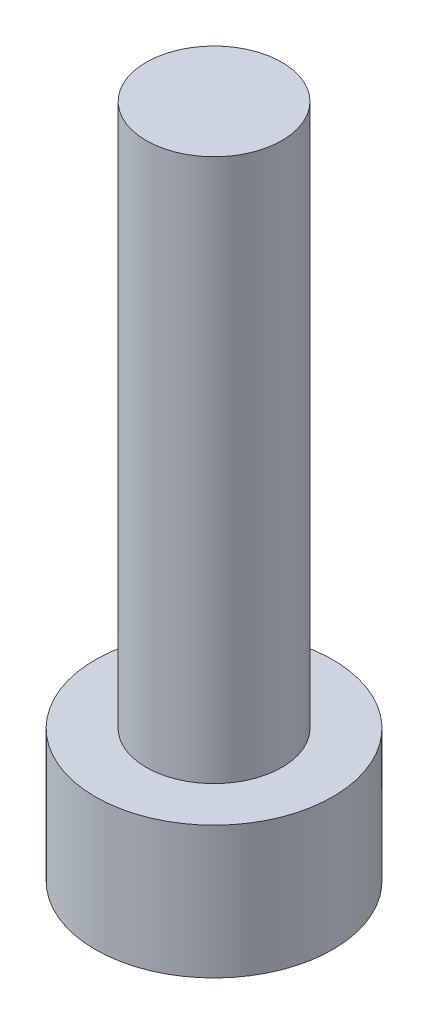
ISO-10303-21;
HEADER;
FILE_DESCRIPTION(('STEP AP214'),'2;1');
FILE_NAME('part.step','',(''),(''),'','','');
FILE_SCHEMA(('AUTOMOTIVE_DESIGN { 1 0 10303 214 1 1 1 1 }'));
ENDSEC;
DATA;
#1=APPLICATION_CONTEXT('core data for automotive mechanical design processes');
#2=APPLICATION_PROTOCOL_DEFINITION('international standard','automotive_design',2000,#1);
#3=PRODUCT_CONTEXT('',#1,'mechanical');
#4=PRODUCT('Part','Part','',(#3));
#5=PRODUCT_RELATED_PRODUCT_CATEGORY('part','',(#4));
#6=PRODUCT_DEFINITION_FORMATION('','',#4);
#7=PRODUCT_DEFINITION_CONTEXT('part definition',#1,'design');
#8=PRODUCT_DEFINITION('design','',#6,#7);
#9=PRODUCT_DEFINITION_SHAPE('','',#8);
#10=(LENGTH_UNIT() NAMED_UNIT(*) SI_UNIT(.MILLI.,.METRE.));
#11=(NAMED_UNIT(*) PLANE_ANGLE_UNIT() SI_UNIT($,.RADIAN.));
#12=(NAMED_UNIT(*) SI_UNIT($,.STERADIAN.) SOLID_ANGLE_UNIT());
#13=UNCERTAINTY_MEASURE_WITH_UNIT(LENGTH_MEASURE(1.E-05),#10,'distance_accuracy_value','');
#14=(GEOMETRIC_REPRESENTATION_CONTEXT(3) GLOBAL_UNCERTAINTY_ASSIGNED_CONTEXT((#13)) GLOBAL_UNIT_ASSIGNED_CONTEXT((#10,
#11,#12)) REPRESENTATION_CONTEXT('',''));
#15=CARTESIAN_POINT('',(0.,0.,0.));
#16=DIRECTION('',(0.,0.,1.));
#17=DIRECTION('',(1.,0.,0.));
#18=AXIS2_PLACEMENT_3D('',#15,#16,#17);
#19=CARTESIAN_POINT('',(0.,3.9,0.));
#20=DIRECTION('',(0.,-1.,0.));
#21=DIRECTION('',(0.,0.,-1.));
#22=AXIS2_PLACEMENT_3D('',#19,#20,#21);
#23=CYLINDRICAL_SURFACE('',#22,3.5);
#24=CARTESIAN_POINT('',(0.,3.9,0.));
#25=DIRECTION('',(0.,1.,0.));
#26=DIRECTION('',(0.,0.,1.));
#27=AXIS2_PLACEMENT_3D('',#24,#25,#26);
#28=CIRCLE('',#27,3.5);
#29=CARTESIAN_POINT('',(0.,3.9,3.5));
#30=VERTEX_POINT('',#29);
#31=EDGE_CURVE('E43',#30,#30,#28,.T.);
#32=ORIENTED_EDGE('',*,*,#31,.F.);
#33=EDGE_LOOP('',(#32));
#34=FACE_BOUND('',#33,.T.);
#35=CARTESIAN_POINT('',(0.,0.,0.));
#36=DIRECTION('',(0.,1.,0.));
#37=DIRECTION('',(0.,0.,1.));
#38=AXIS2_PLACEMENT_3D('',#35,#36,#37);
#39=CIRCLE('',#38,3.5);
#40=CARTESIAN_POINT('',(0.,0.,3.5));
#41=VERTEX_POINT('',#40);
#42=EDGE_CURVE('E38',#41,#41,#39,.T.);
#43=ORIENTED_EDGE('',*,*,#42,.T.);
#44=EDGE_LOOP('',(#43));
#45=FACE_BOUND('',#44,.T.);
#46=ADVANCED_FACE('F35',(#34,#45),#23,.T.);
#47=CARTESIAN_POINT('',(0.,3.9,0.));
#48=DIRECTION('',(0.,1.,0.));
#49=DIRECTION('',(0.,0.,1.));
#50=AXIS2_PLACEMENT_3D('',#47,#48,#49);
#51=PLANE('',#50);
#52=CARTESIAN_POINT('',(0.,3.9,0.));
#53=DIRECTION('',(0.,1.,0.));
#54=DIRECTION('',(0.,0.,1.));
#55=AXIS2_PLACEMENT_3D('',#52,#53,#54);
#56=CIRCLE('',#55,2.);
#57=CARTESIAN_POINT('',(0.,3.9,2.));
#58=VERTEX_POINT('',#57);
#59=EDGE_CURVE('E11',#58,#58,#56,.T.);
#60=ORIENTED_EDGE('',*,*,#59,.F.);
#61=EDGE_LOOP('',(#60));
#62=FACE_BOUND('',#61,.T.);
#63=ORIENTED_EDGE('',*,*,#31,.T.);
#64=EDGE_LOOP('',(#63));
#65=FACE_BOUND('',#64,.T.);
#66=ADVANCED_FACE('F155',(#62,#65),#51,.T.);
#67=CARTESIAN_POINT('',(0.,0.,0.));
#68=DIRECTION('',(0.,1.,0.));
#69=DIRECTION('',(0.,0.,1.));
#70=AXIS2_PLACEMENT_3D('',#67,#68,#69);
#71=PLANE('',#70);
#72=DIRECTION('',(-0.5,0.,0.866025403784438));
#73=VECTOR('',#72,1.);
#74=CARTESIAN_POINT('',(1.725,0.,0.));
#75=LINE('',#74,#73);
#76=CARTESIAN_POINT('',(1.725,0.,0.));
#77=VERTEX_POINT('',#76);
#78=CARTESIAN_POINT('',(0.862499999999999,0.,1.49389382152816));
#79=VERTEX_POINT('',#78);
#80=EDGE_CURVE('E125',#77,#79,#75,.T.);
#81=ORIENTED_EDGE('',*,*,#80,.F.);
#82=DIRECTION('',(0.5,0.,0.866025403784439));
#83=VECTOR('',#82,1.);
#84=CARTESIAN_POINT('',(0.8625,0.,-1.49389382152816));
#85=LINE('',#84,#83);
#86=CARTESIAN_POINT('',(0.8625,0.,-1.49389382152816));
#87=VERTEX_POINT('',#86);
#88=EDGE_CURVE('E51',#87,#77,#85,.T.);
#89=ORIENTED_EDGE('',*,*,#88,.F.);
#90=DIRECTION('',(1.,0.,0.));
#91=VECTOR('',#90,1.);
#92=CARTESIAN_POINT('',(-0.8625,0.,-1.49389382152816));
#93=LINE('',#92,#91);
#94=CARTESIAN_POINT('',(-0.8625,0.,-1.49389382152816));
#95=VERTEX_POINT('',#94);
#96=EDGE_CURVE('E134',#95,#87,#93,.T.);
#97=ORIENTED_EDGE('',*,*,#96,.F.);
#98=DIRECTION('',(0.5,0.,-0.866025403784439));
#99=VECTOR('',#98,1.);
#100=CARTESIAN_POINT('',(-1.725,0.,0.));
#101=LINE('',#100,#99);
#102=CARTESIAN_POINT('',(-1.725,0.,0.));
#103=VERTEX_POINT('',#102);
#104=EDGE_CURVE('E132',#103,#95,#101,.T.);
#105=ORIENTED_EDGE('',*,*,#104,.F.);
#106=DIRECTION('',(-0.5,0.,-0.866025403784439));
#107=VECTOR('',#106,1.);
#108=CARTESIAN_POINT('',(-0.8625,0.,1.49389382152816));
#109=LINE('',#108,#107);
#110=CARTESIAN_POINT('',(-0.8625,0.,1.49389382152816));
#111=VERTEX_POINT('',#110);
#112=EDGE_CURVE('E99',#111,#103,#109,.T.);
#113=ORIENTED_EDGE('',*,*,#112,.F.);
#114=DIRECTION('',(-1.,0.,0.));
#115=VECTOR('',#114,1.);
#116=CARTESIAN_POINT('',(0.862499999999999,0.,1.49389382152816));
#117=LINE('',#116,#115);
#118=EDGE_CURVE('E128',#79,#111,#117,.T.);
#119=ORIENTED_EDGE('',*,*,#118,.F.);
#120=EDGE_LOOP('',(#81,#89,#97,#105,#113,#119));
#121=FACE_BOUND('',#120,.T.);
#122=ORIENTED_EDGE('',*,*,#42,.F.);
#123=EDGE_LOOP('',(#122));
#124=FACE_BOUND('',#123,.T.);
#125=ADVANCED_FACE('F152',(#121,#124),#71,.F.);
#126=CARTESIAN_POINT('',(0.,19.9,0.));
#127=DIRECTION('',(0.,-1.,0.));
#128=DIRECTION('',(0.,0.,-1.));
#129=AXIS2_PLACEMENT_3D('',#126,#127,#128);
#130=CYLINDRICAL_SURFACE('',#129,2.);
#131=CARTESIAN_POINT('',(0.,19.9,0.));
#132=DIRECTION('',(0.,1.,0.));
#133=DIRECTION('',(0.,0.,1.));
#134=AXIS2_PLACEMENT_3D('',#131,#132,#133);
#135=CIRCLE('',#134,2.);
#136=CARTESIAN_POINT('',(0.,19.9,2.));
#137=VERTEX_POINT('',#136);
#138=EDGE_CURVE('E138',#137,#137,#135,.T.);
#139=ORIENTED_EDGE('',*,*,#138,.F.);
#140=EDGE_LOOP('',(#139));
#141=FACE_BOUND('',#140,.T.);
#142=ORIENTED_EDGE('',*,*,#59,.T.);
#143=EDGE_LOOP('',(#142));
#144=FACE_BOUND('',#143,.T.);
#145=ADVANCED_FACE('F154',(#141,#144),#130,.T.);
#146=CARTESIAN_POINT('',(0.,19.9,0.));
#147=DIRECTION('',(0.,1.,0.));
#148=DIRECTION('',(0.,0.,1.));
#149=AXIS2_PLACEMENT_3D('',#146,#147,#148);
#150=PLANE('',#149);
#151=ORIENTED_EDGE('',*,*,#138,.T.);
#152=EDGE_LOOP('',(#151));
#153=FACE_BOUND('',#152,.T.);
#154=ADVANCED_FACE('F161',(#153),#150,.T.);
#155=CARTESIAN_POINT('',(0.8625,2.4,-1.49389382152816));
#156=DIRECTION('',(0.866025403784439,0.,-0.5));
#157=DIRECTION('',(-0.5,0.,-0.866025403784439));
#158=AXIS2_PLACEMENT_3D('',#155,#156,#157);
#159=PLANE('',#158);
#160=ORIENTED_EDGE('',*,*,#88,.T.);
#161=DIRECTION('',(0.,-1.,0.));
#162=VECTOR('',#161,1.);
#163=CARTESIAN_POINT('',(1.725,2.4,0.));
#164=LINE('',#163,#162);
#165=CARTESIAN_POINT('',(1.725,2.4,0.));
#166=VERTEX_POINT('',#165);
#167=EDGE_CURVE('E81',#166,#77,#164,.T.);
#168=ORIENTED_EDGE('',*,*,#167,.F.);
#169=DIRECTION('',(0.5,0.,0.866025403784439));
#170=VECTOR('',#169,1.);
#171=CARTESIAN_POINT('',(0.8625,2.4,-1.49389382152816));
#172=LINE('',#171,#170);
#173=CARTESIAN_POINT('',(0.8625,2.4,-1.49389382152816));
#174=VERTEX_POINT('',#173);
#175=EDGE_CURVE('E136',#174,#166,#172,.T.);
#176=ORIENTED_EDGE('',*,*,#175,.F.);
#177=DIRECTION('',(0.,-1.,0.));
#178=VECTOR('',#177,1.);
#179=CARTESIAN_POINT('',(0.8625,2.4,-1.49389382152816));
#180=LINE('',#179,#178);
#181=EDGE_CURVE('E59',#174,#87,#180,.T.);
#182=ORIENTED_EDGE('',*,*,#181,.T.);
#183=EDGE_LOOP('',(#160,#168,#176,#182));
#184=FACE_BOUND('',#183,.T.);
#185=ADVANCED_FACE('F190',(#184),#159,.F.);
#186=CARTESIAN_POINT('',(-0.8625,2.4,-1.49389382152816));
#187=DIRECTION('',(0.,0.,-1.));
#188=DIRECTION('',(-1.,0.,0.));
#189=AXIS2_PLACEMENT_3D('',#186,#187,#188);
#190=PLANE('',#189);
#191=ORIENTED_EDGE('',*,*,#96,.T.);
#192=ORIENTED_EDGE('',*,*,#181,.F.);
#193=DIRECTION('',(1.,0.,0.));
#194=VECTOR('',#193,1.);
#195=CARTESIAN_POINT('',(-0.8625,2.4,-1.49389382152816));
#196=LINE('',#195,#194);
#197=CARTESIAN_POINT('',(-0.8625,2.4,-1.49389382152816));
#198=VERTEX_POINT('',#197);
#199=EDGE_CURVE('E111',#198,#174,#196,.T.);
#200=ORIENTED_EDGE('',*,*,#199,.F.);
#201=DIRECTION('',(0.,-1.,0.));
#202=VECTOR('',#201,1.);
#203=CARTESIAN_POINT('',(-0.8625,2.4,-1.49389382152816));
#204=LINE('',#203,#202);
#205=EDGE_CURVE('E103',#198,#95,#204,.T.);
#206=ORIENTED_EDGE('',*,*,#205,.T.);
#207=EDGE_LOOP('',(#191,#192,#200,#206));
#208=FACE_BOUND('',#207,.T.);
#209=ADVANCED_FACE('F204',(#208),#190,.F.);
#210=CARTESIAN_POINT('',(-1.725,2.4,0.));
#211=DIRECTION('',(-0.866025403784439,0.,-0.5));
#212=DIRECTION('',(-0.5,0.,0.866025403784439));
#213=AXIS2_PLACEMENT_3D('',#210,#211,#212);
#214=PLANE('',#213);
#215=ORIENTED_EDGE('',*,*,#104,.T.);
#216=ORIENTED_EDGE('',*,*,#205,.F.);
#217=DIRECTION('',(0.5,0.,-0.866025403784439));
#218=VECTOR('',#217,1.);
#219=CARTESIAN_POINT('',(-1.725,2.4,0.));
#220=LINE('',#219,#218);
#221=CARTESIAN_POINT('',(-1.725,2.4,0.));
#222=VERTEX_POINT('',#221);
#223=EDGE_CURVE('E107',#222,#198,#220,.T.);
#224=ORIENTED_EDGE('',*,*,#223,.F.);
#225=DIRECTION('',(0.,-1.,0.));
#226=VECTOR('',#225,1.);
#227=CARTESIAN_POINT('',(-1.725,2.4,0.));
#228=LINE('',#227,#226);
#229=EDGE_CURVE('E92',#222,#103,#228,.T.);
#230=ORIENTED_EDGE('',*,*,#229,.T.);
#231=EDGE_LOOP('',(#215,#216,#224,#230));
#232=FACE_BOUND('',#231,.T.);
#233=ADVANCED_FACE('F108',(#232),#214,.F.);
#234=CARTESIAN_POINT('',(-0.8625,2.4,1.49389382152816));
#235=DIRECTION('',(-0.866025403784439,0.,0.5));
#236=DIRECTION('',(0.5,0.,0.866025403784439));
#237=AXIS2_PLACEMENT_3D('',#234,#235,#236);
#238=PLANE('',#237);
#239=ORIENTED_EDGE('',*,*,#112,.T.);
#240=ORIENTED_EDGE('',*,*,#229,.F.);
#241=DIRECTION('',(-0.5,0.,-0.866025403784439));
#242=VECTOR('',#241,1.);
#243=CARTESIAN_POINT('',(-0.8625,2.4,1.49389382152816));
#244=LINE('',#243,#242);
#245=CARTESIAN_POINT('',(-0.8625,2.4,1.49389382152816));
#246=VERTEX_POINT('',#245);
#247=EDGE_CURVE('E96',#246,#222,#244,.T.);
#248=ORIENTED_EDGE('',*,*,#247,.F.);
#249=DIRECTION('',(0.,-1.,0.));
#250=VECTOR('',#249,1.);
#251=CARTESIAN_POINT('',(-0.8625,2.4,1.49389382152816));
#252=LINE('',#251,#250);
#253=EDGE_CURVE('E104',#246,#111,#252,.T.);
#254=ORIENTED_EDGE('',*,*,#253,.T.);
#255=EDGE_LOOP('',(#239,#240,#248,#254));
#256=FACE_BOUND('',#255,.T.);
#257=ADVANCED_FACE('F94',(#256),#238,.F.);
#258=CARTESIAN_POINT('',(0.862499999999999,2.4,1.49389382152816));
#259=DIRECTION('',(0.,0.,1.));
#260=DIRECTION('',(1.,0.,0.));
#261=AXIS2_PLACEMENT_3D('',#258,#259,#260);
#262=PLANE('',#261);
#263=ORIENTED_EDGE('',*,*,#118,.T.);
#264=ORIENTED_EDGE('',*,*,#253,.F.);
#265=DIRECTION('',(-1.,0.,0.));
#266=VECTOR('',#265,1.);
#267=CARTESIAN_POINT('',(0.862499999999999,2.4,1.49389382152816));
#268=LINE('',#267,#266);
#269=CARTESIAN_POINT('',(0.862499999999999,2.4,1.49389382152816));
#270=VERTEX_POINT('',#269);
#271=EDGE_CURVE('E117',#270,#246,#268,.T.);
#272=ORIENTED_EDGE('',*,*,#271,.F.);
#273=DIRECTION('',(0.,-1.,0.));
#274=VECTOR('',#273,1.);
#275=CARTESIAN_POINT('',(0.862499999999999,2.4,1.49389382152816));
#276=LINE('',#275,#274);
#277=EDGE_CURVE('E141',#270,#79,#276,.T.);
#278=ORIENTED_EDGE('',*,*,#277,.T.);
#279=EDGE_LOOP('',(#263,#264,#272,#278));
#280=FACE_BOUND('',#279,.T.);
#281=ADVANCED_FACE('F229',(#280),#262,.F.);
#282=CARTESIAN_POINT('',(1.725,2.4,0.));
#283=DIRECTION('',(0.866025403784439,0.,0.5));
#284=DIRECTION('',(0.5,0.,-0.866025403784439));
#285=AXIS2_PLACEMENT_3D('',#282,#283,#284);
#286=PLANE('',#285);
#287=ORIENTED_EDGE('',*,*,#80,.T.);
#288=ORIENTED_EDGE('',*,*,#277,.F.);
#289=DIRECTION('',(-0.5,0.,0.866025403784438));
#290=VECTOR('',#289,1.);
#291=CARTESIAN_POINT('',(1.725,2.4,0.));
#292=LINE('',#291,#290);
#293=EDGE_CURVE('E119',#166,#270,#292,.T.);
#294=ORIENTED_EDGE('',*,*,#293,.F.);
#295=ORIENTED_EDGE('',*,*,#167,.T.);
#296=EDGE_LOOP('',(#287,#288,#294,#295));
#297=FACE_BOUND('',#296,.T.);
#298=ADVANCED_FACE('F238',(#297),#286,.F.);
#299=CARTESIAN_POINT('',(0.,2.4,0.));
#300=DIRECTION('',(0.,-1.,0.));
#301=DIRECTION('',(0.,0.,-1.));
#302=AXIS2_PLACEMENT_3D('',#299,#300,#301);
#303=PLANE('',#302);
#304=ORIENTED_EDGE('',*,*,#175,.T.);
#305=ORIENTED_EDGE('',*,*,#293,.T.);
#306=ORIENTED_EDGE('',*,*,#271,.T.);
#307=ORIENTED_EDGE('',*,*,#247,.T.);
#308=ORIENTED_EDGE('',*,*,#223,.T.);
#309=ORIENTED_EDGE('',*,*,#199,.T.);
#310=EDGE_LOOP('',(#304,#305,#306,#307,#308,#309));
#311=FACE_BOUND('',#310,.T.);
#312=ADVANCED_FACE('F114',(#311),#303,.T.);
#313=CLOSED_SHELL('',(#46,#66,#125,#145,#154,#185,#209,#233,#257,#281,#298,#312));
#314=MANIFOLD_SOLID_BREP('B2',#313);
#315=ADVANCED_BREP_SHAPE_REPRESENTATION('',(#18,#314),#14);
#316=SHAPE_DEFINITION_REPRESENTATION(#9,#315);
ENDSEC;
END-ISO-10303-21;
